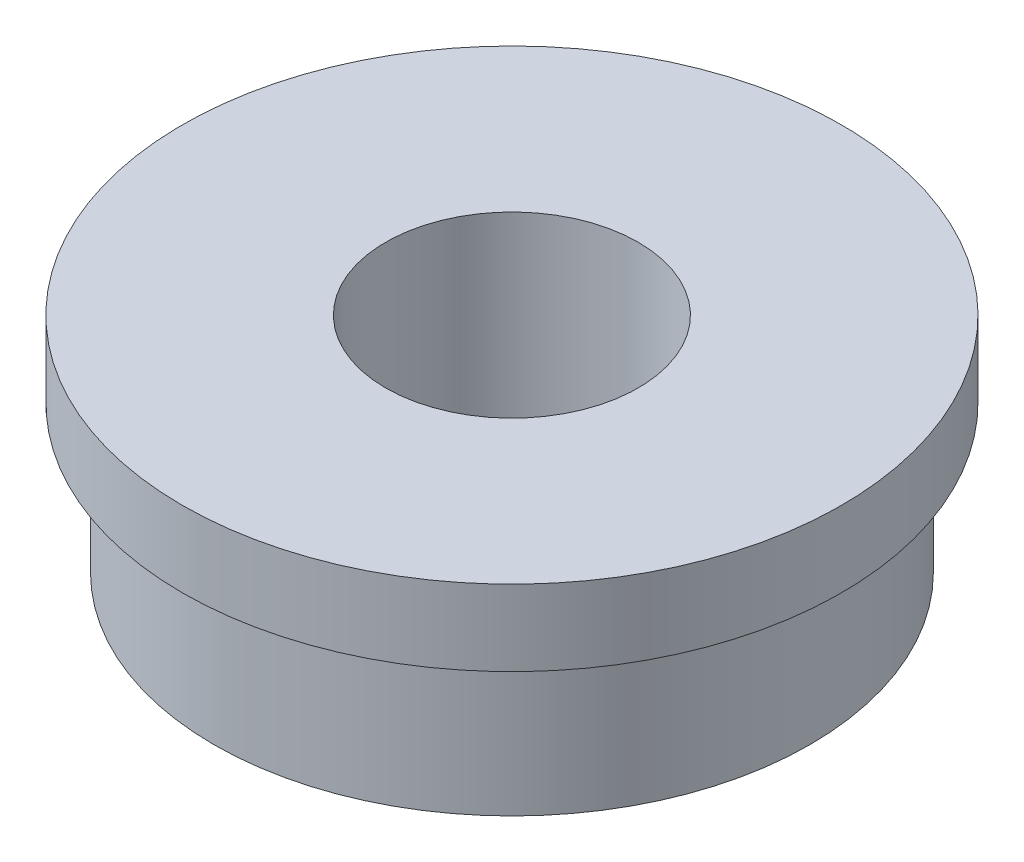
ISO-10303-21;
HEADER;
FILE_DESCRIPTION(('STEP AP214'),'2;1');
FILE_NAME('part.step','',(''),(''),'','','');
FILE_SCHEMA(('AUTOMOTIVE_DESIGN { 1 0 10303 214 1 1 1 1 }'));
ENDSEC;
DATA;
#1=APPLICATION_CONTEXT('core data for automotive mechanical design processes');
#2=APPLICATION_PROTOCOL_DEFINITION('international standard','automotive_design',2000,#1);
#3=PRODUCT_CONTEXT('',#1,'mechanical');
#4=PRODUCT('Part','Part','',(#3));
#5=PRODUCT_RELATED_PRODUCT_CATEGORY('part','',(#4));
#6=PRODUCT_DEFINITION_FORMATION('','',#4);
#7=PRODUCT_DEFINITION_CONTEXT('part definition',#1,'design');
#8=PRODUCT_DEFINITION('design','',#6,#7);
#9=PRODUCT_DEFINITION_SHAPE('','',#8);
#10=(LENGTH_UNIT() NAMED_UNIT(*) SI_UNIT(.MILLI.,.METRE.));
#11=(NAMED_UNIT(*) PLANE_ANGLE_UNIT() SI_UNIT($,.RADIAN.));
#12=(NAMED_UNIT(*) SI_UNIT($,.STERADIAN.) SOLID_ANGLE_UNIT());
#13=UNCERTAINTY_MEASURE_WITH_UNIT(LENGTH_MEASURE(1.E-05),#10,'distance_accuracy_value','');
#14=(GEOMETRIC_REPRESENTATION_CONTEXT(3) GLOBAL_UNCERTAINTY_ASSIGNED_CONTEXT((#13)) GLOBAL_UNIT_ASSIGNED_CONTEXT((#10,
#11,#12)) REPRESENTATION_CONTEXT('',''));
#15=CARTESIAN_POINT('',(0.,0.,0.));
#16=DIRECTION('',(0.,0.,1.));
#17=DIRECTION('',(1.,0.,0.));
#18=AXIS2_PLACEMENT_3D('',#15,#16,#17);
#19=CARTESIAN_POINT('',(0.,7.14375,0.));
#20=DIRECTION('',(0.,-1.,0.));
#21=DIRECTION('',(0.,0.,-1.));
#22=AXIS2_PLACEMENT_3D('',#19,#20,#21);
#23=CYLINDRICAL_SURFACE('',#22,11.2395);
#24=CARTESIAN_POINT('',(0.,3.889375,0.));
#25=DIRECTION('',(0.,1.,0.));
#26=DIRECTION('',(0.,0.,1.));
#27=AXIS2_PLACEMENT_3D('',#24,#25,#26);
#28=CIRCLE('',#27,11.2395);
#29=CARTESIAN_POINT('',(0.,3.889375,11.2395));
#30=VERTEX_POINT('',#29);
#31=EDGE_CURVE('E11',#30,#30,#28,.F.);
#32=ORIENTED_EDGE('',*,*,#31,.T.);
#33=EDGE_LOOP('',(#32));
#34=FACE_BOUND('',#33,.T.);
#35=CARTESIAN_POINT('',(0.,-1.27,0.));
#36=DIRECTION('',(0.,1.,0.));
#37=DIRECTION('',(0.,0.,1.));
#38=AXIS2_PLACEMENT_3D('',#35,#36,#37);
#39=CIRCLE('',#38,11.2395);
#40=CARTESIAN_POINT('',(0.,-1.27,11.2395));
#41=VERTEX_POINT('',#40);
#42=EDGE_CURVE('E54',#41,#41,#39,.T.);
#43=ORIENTED_EDGE('',*,*,#42,.T.);
#44=EDGE_LOOP('',(#43));
#45=FACE_BOUND('',#44,.T.);
#46=ADVANCED_FACE('F40',(#34,#45),#23,.T.);
#47=CARTESIAN_POINT('',(0.,-1.27,0.));
#48=DIRECTION('',(0.,1.,0.));
#49=DIRECTION('',(0.,0.,1.));
#50=AXIS2_PLACEMENT_3D('',#47,#48,#49);
#51=PLANE('',#50);
#52=CARTESIAN_POINT('',(0.,-1.27,0.));
#53=DIRECTION('',(0.,1.,0.));
#54=DIRECTION('',(0.,0.,1.));
#55=AXIS2_PLACEMENT_3D('',#52,#53,#54);
#56=CIRCLE('',#55,4.7625);
#57=CARTESIAN_POINT('',(0.,-1.27,4.7625));
#58=VERTEX_POINT('',#57);
#59=EDGE_CURVE('E66',#58,#58,#56,.F.);
#60=ORIENTED_EDGE('',*,*,#59,.F.);
#61=EDGE_LOOP('',(#60));
#62=FACE_BOUND('',#61,.T.);
#63=ORIENTED_EDGE('',*,*,#42,.F.);
#64=EDGE_LOOP('',(#63));
#65=FACE_BOUND('',#64,.T.);
#66=ADVANCED_FACE('F90',(#62,#65),#51,.F.);
#67=CARTESIAN_POINT('',(0.,5.55625,0.));
#68=DIRECTION('',(0.,1.,0.));
#69=DIRECTION('',(0.,0.,1.));
#70=AXIS2_PLACEMENT_3D('',#67,#68,#69);
#71=CYLINDRICAL_SURFACE('',#70,12.430125);
#72=CARTESIAN_POINT('',(0.,4.28625,0.));
#73=DIRECTION('',(0.,1.,0.));
#74=DIRECTION('',(0.,0.,1.));
#75=AXIS2_PLACEMENT_3D('',#72,#73,#74);
#76=CIRCLE('',#75,12.430125);
#77=CARTESIAN_POINT('',(0.,4.28625,12.430125));
#78=VERTEX_POINT('',#77);
#79=EDGE_CURVE('E59',#78,#78,#76,.T.);
#80=ORIENTED_EDGE('',*,*,#79,.T.);
#81=EDGE_LOOP('',(#80));
#82=FACE_BOUND('',#81,.T.);
#83=CARTESIAN_POINT('',(0.,7.14375,0.));
#84=DIRECTION('',(0.,1.,0.));
#85=DIRECTION('',(0.,0.,1.));
#86=AXIS2_PLACEMENT_3D('',#83,#84,#85);
#87=CIRCLE('',#86,12.430125);
#88=CARTESIAN_POINT('',(0.,7.14375,12.430125));
#89=VERTEX_POINT('',#88);
#90=EDGE_CURVE('E62',#89,#89,#87,.T.);
#91=ORIENTED_EDGE('',*,*,#90,.F.);
#92=EDGE_LOOP('',(#91));
#93=FACE_BOUND('',#92,.T.);
#94=ADVANCED_FACE('F88',(#82,#93),#71,.T.);
#95=CARTESIAN_POINT('',(0.,4.28625,0.));
#96=DIRECTION('',(0.,1.,0.));
#97=DIRECTION('',(0.,0.,1.));
#98=AXIS2_PLACEMENT_3D('',#95,#96,#97);
#99=PLANE('',#98);
#100=CARTESIAN_POINT('',(0.,4.28625,0.));
#101=DIRECTION('',(0.,1.,0.));
#102=DIRECTION('',(0.,0.,1.));
#103=AXIS2_PLACEMENT_3D('',#100,#101,#102);
#104=CIRCLE('',#103,11.636375);
#105=CARTESIAN_POINT('',(0.,4.28625,11.636375));
#106=VERTEX_POINT('',#105);
#107=EDGE_CURVE('E49',#106,#106,#104,.T.);
#108=ORIENTED_EDGE('',*,*,#107,.T.);
#109=EDGE_LOOP('',(#108));
#110=FACE_BOUND('',#109,.T.);
#111=ORIENTED_EDGE('',*,*,#79,.F.);
#112=EDGE_LOOP('',(#111));
#113=FACE_BOUND('',#112,.T.);
#114=ADVANCED_FACE('F84',(#110,#113),#99,.F.);
#115=CARTESIAN_POINT('',(0.,7.14375,0.));
#116=DIRECTION('',(0.,1.,0.));
#117=DIRECTION('',(0.,0.,1.));
#118=AXIS2_PLACEMENT_3D('',#115,#116,#117);
#119=PLANE('',#118);
#120=CARTESIAN_POINT('',(0.,7.14375,0.));
#121=DIRECTION('',(0.,1.,0.));
#122=DIRECTION('',(0.,0.,1.));
#123=AXIS2_PLACEMENT_3D('',#120,#121,#122);
#124=CIRCLE('',#123,4.7625);
#125=CARTESIAN_POINT('',(0.,7.14375,4.7625));
#126=VERTEX_POINT('',#125);
#127=EDGE_CURVE('E73',#126,#126,#124,.T.);
#128=ORIENTED_EDGE('',*,*,#127,.F.);
#129=EDGE_LOOP('',(#128));
#130=FACE_BOUND('',#129,.T.);
#131=ORIENTED_EDGE('',*,*,#90,.T.);
#132=EDGE_LOOP('',(#131));
#133=FACE_BOUND('',#132,.T.);
#134=ADVANCED_FACE('F81',(#130,#133),#119,.T.);
#135=CARTESIAN_POINT('',(0.,7.14375,0.));
#136=DIRECTION('',(0.,-1.,0.));
#137=DIRECTION('',(0.,0.,-1.));
#138=AXIS2_PLACEMENT_3D('',#135,#136,#137);
#139=CYLINDRICAL_SURFACE('',#138,4.7625);
#140=ORIENTED_EDGE('',*,*,#127,.T.);
#141=EDGE_LOOP('',(#140));
#142=FACE_BOUND('',#141,.T.);
#143=ORIENTED_EDGE('',*,*,#59,.T.);
#144=EDGE_LOOP('',(#143));
#145=FACE_BOUND('',#144,.T.);
#146=ADVANCED_FACE('F78',(#142,#145),#139,.F.);
#147=CARTESIAN_POINT('',(0.,4.28625,0.));
#148=DIRECTION('',(0.,1.,0.));
#149=DIRECTION('',(0.,0.,1.));
#150=AXIS2_PLACEMENT_3D('',#147,#148,#149);
#151=CONICAL_SURFACE('',#150,11.636375,0.78539816339745);
#152=ORIENTED_EDGE('',*,*,#31,.F.);
#153=EDGE_LOOP('',(#152));
#154=FACE_BOUND('',#153,.T.);
#155=ORIENTED_EDGE('',*,*,#107,.F.);
#156=EDGE_LOOP('',(#155));
#157=FACE_BOUND('',#156,.T.);
#158=ADVANCED_FACE('F43',(#154,#157),#151,.T.);
#159=CLOSED_SHELL('',(#46,#66,#94,#114,#134,#146,#158));
#160=MANIFOLD_SOLID_BREP('B2',#159);
#161=ADVANCED_BREP_SHAPE_REPRESENTATION('',(#18,#160),#14);
#162=SHAPE_DEFINITION_REPRESENTATION(#9,#161);
ENDSEC;
END-ISO-10303-21;
